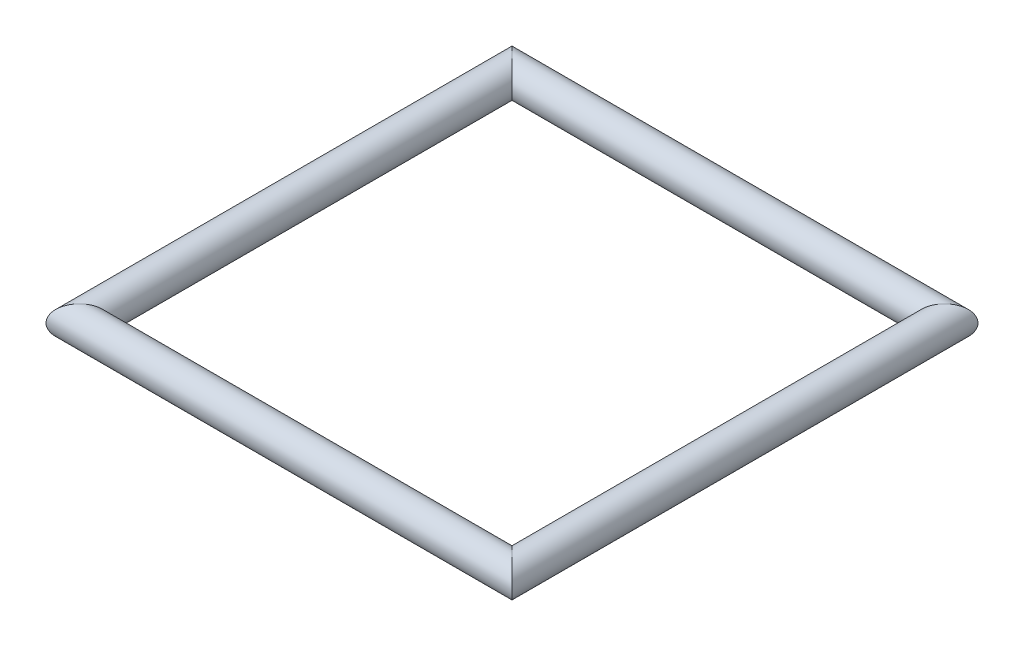
ISO-10303-21;
HEADER;
FILE_DESCRIPTION(('STEP AP214'),'2;1');
FILE_NAME('part.step','',(''),(''),'','','');
FILE_SCHEMA(('AUTOMOTIVE_DESIGN { 1 0 10303 214 1 1 1 1 }'));
ENDSEC;
DATA;
#1=APPLICATION_CONTEXT('core data for automotive mechanical design processes');
#2=APPLICATION_PROTOCOL_DEFINITION('international standard','automotive_design',2000,#1);
#3=PRODUCT_CONTEXT('',#1,'mechanical');
#4=PRODUCT('Part','Part','',(#3));
#5=PRODUCT_RELATED_PRODUCT_CATEGORY('part','',(#4));
#6=PRODUCT_DEFINITION_FORMATION('','',#4);
#7=PRODUCT_DEFINITION_CONTEXT('part definition',#1,'design');
#8=PRODUCT_DEFINITION('design','',#6,#7);
#9=PRODUCT_DEFINITION_SHAPE('','',#8);
#10=(LENGTH_UNIT() NAMED_UNIT(*) SI_UNIT(.MILLI.,.METRE.));
#11=(NAMED_UNIT(*) PLANE_ANGLE_UNIT() SI_UNIT($,.RADIAN.));
#12=(NAMED_UNIT(*) SI_UNIT($,.STERADIAN.) SOLID_ANGLE_UNIT());
#13=UNCERTAINTY_MEASURE_WITH_UNIT(LENGTH_MEASURE(1.E-05),#10,'distance_accuracy_value','');
#14=(GEOMETRIC_REPRESENTATION_CONTEXT(3) GLOBAL_UNCERTAINTY_ASSIGNED_CONTEXT((#13)) GLOBAL_UNIT_ASSIGNED_CONTEXT((#10,
#11,#12)) REPRESENTATION_CONTEXT('',''));
#15=CARTESIAN_POINT('',(0.,0.,0.));
#16=DIRECTION('',(0.,0.,1.));
#17=DIRECTION('',(1.,0.,0.));
#18=AXIS2_PLACEMENT_3D('',#15,#16,#17);
#19=CARTESIAN_POINT('',(650.,0.,-705.1));
#20=DIRECTION('',(0.,0.,1.));
#21=DIRECTION('',(1.,0.,0.));
#22=AXIS2_PLACEMENT_3D('',#19,#20,#21);
#23=CYLINDRICAL_SURFACE('',#22,50.);
#24=CARTESIAN_POINT('',(650.,0.,-650.));
#25=DIRECTION('',(0.707106781186548,0.,0.707106781186547));
#26=DIRECTION('',(0.707106781186547,0.,-0.707106781186548));
#27=AXIS2_PLACEMENT_3D('',#24,#25,#26);
#28=ELLIPSE('',#27,70.7106781186548,50.);
#29=CARTESIAN_POINT('',(700.,0.,-700.));
#30=VERTEX_POINT('',#29);
#31=EDGE_CURVE('E56',#30,#30,#28,.F.);
#32=ORIENTED_EDGE('',*,*,#31,.F.);
#33=EDGE_LOOP('',(#32));
#34=FACE_BOUND('',#33,.T.);
#35=CARTESIAN_POINT('',(650.,0.,650.));
#36=DIRECTION('',(-0.707106781186547,0.,0.707106781186548));
#37=DIRECTION('',(-0.707106781186548,0.,-0.707106781186547));
#38=AXIS2_PLACEMENT_3D('',#35,#36,#37);
#39=ELLIPSE('',#38,70.7106781186548,50.);
#40=CARTESIAN_POINT('',(600.,0.,600.));
#41=VERTEX_POINT('',#40);
#42=EDGE_CURVE('E47',#41,#41,#39,.F.);
#43=ORIENTED_EDGE('',*,*,#42,.T.);
#44=EDGE_LOOP('',(#43));
#45=FACE_BOUND('',#44,.T.);
#46=ADVANCED_FACE('F44',(#34,#45),#23,.T.);
#47=CARTESIAN_POINT('',(705.1,0.,650.));
#48=DIRECTION('',(-1.,0.,0.));
#49=DIRECTION('',(0.,0.,1.));
#50=AXIS2_PLACEMENT_3D('',#47,#48,#49);
#51=CYLINDRICAL_SURFACE('',#50,50.);
#52=ORIENTED_EDGE('',*,*,#42,.F.);
#53=EDGE_LOOP('',(#52));
#54=FACE_BOUND('',#53,.T.);
#55=CARTESIAN_POINT('',(-650.,0.,650.));
#56=DIRECTION('',(-0.707106781186548,0.,-0.707106781186547));
#57=DIRECTION('',(0.707106781186547,0.,-0.707106781186548));
#58=AXIS2_PLACEMENT_3D('',#55,#56,#57);
#59=ELLIPSE('',#58,70.7106781186548,50.);
#60=CARTESIAN_POINT('',(-600.,0.,600.));
#61=VERTEX_POINT('',#60);
#62=EDGE_CURVE('E51',#61,#61,#59,.F.);
#63=ORIENTED_EDGE('',*,*,#62,.T.);
#64=EDGE_LOOP('',(#63));
#65=FACE_BOUND('',#64,.T.);
#66=ADVANCED_FACE('F65',(#54,#65),#51,.T.);
#67=CARTESIAN_POINT('',(-705.1,0.,-650.));
#68=DIRECTION('',(1.,0.,0.));
#69=DIRECTION('',(0.,0.,-1.));
#70=AXIS2_PLACEMENT_3D('',#67,#68,#69);
#71=CYLINDRICAL_SURFACE('',#70,50.);
#72=CARTESIAN_POINT('',(-650.,0.,-650.));
#73=DIRECTION('',(0.707106781186547,0.,-0.707106781186548));
#74=DIRECTION('',(-0.707106781186548,0.,-0.707106781186547));
#75=AXIS2_PLACEMENT_3D('',#72,#73,#74);
#76=ELLIPSE('',#75,70.7106781186548,50.);
#77=CARTESIAN_POINT('',(-700.,0.,-700.));
#78=VERTEX_POINT('',#77);
#79=EDGE_CURVE('E11',#78,#78,#76,.F.);
#80=ORIENTED_EDGE('',*,*,#79,.F.);
#81=EDGE_LOOP('',(#80));
#82=FACE_BOUND('',#81,.T.);
#83=ORIENTED_EDGE('',*,*,#31,.T.);
#84=EDGE_LOOP('',(#83));
#85=FACE_BOUND('',#84,.T.);
#86=ADVANCED_FACE('F68',(#82,#85),#71,.T.);
#87=CARTESIAN_POINT('',(-650.,0.,705.1));
#88=DIRECTION('',(0.,0.,-1.));
#89=DIRECTION('',(-1.,0.,0.));
#90=AXIS2_PLACEMENT_3D('',#87,#88,#89);
#91=CYLINDRICAL_SURFACE('',#90,50.);
#92=ORIENTED_EDGE('',*,*,#62,.F.);
#93=EDGE_LOOP('',(#92));
#94=FACE_BOUND('',#93,.T.);
#95=ORIENTED_EDGE('',*,*,#79,.T.);
#96=EDGE_LOOP('',(#95));
#97=FACE_BOUND('',#96,.T.);
#98=ADVANCED_FACE('F71',(#94,#97),#91,.T.);
#99=CLOSED_SHELL('',(#46,#66,#86,#98));
#100=MANIFOLD_SOLID_BREP('B2',#99);
#101=ADVANCED_BREP_SHAPE_REPRESENTATION('',(#18,#100),#14);
#102=SHAPE_DEFINITION_REPRESENTATION(#9,#101);
ENDSEC;
END-ISO-10303-21;
